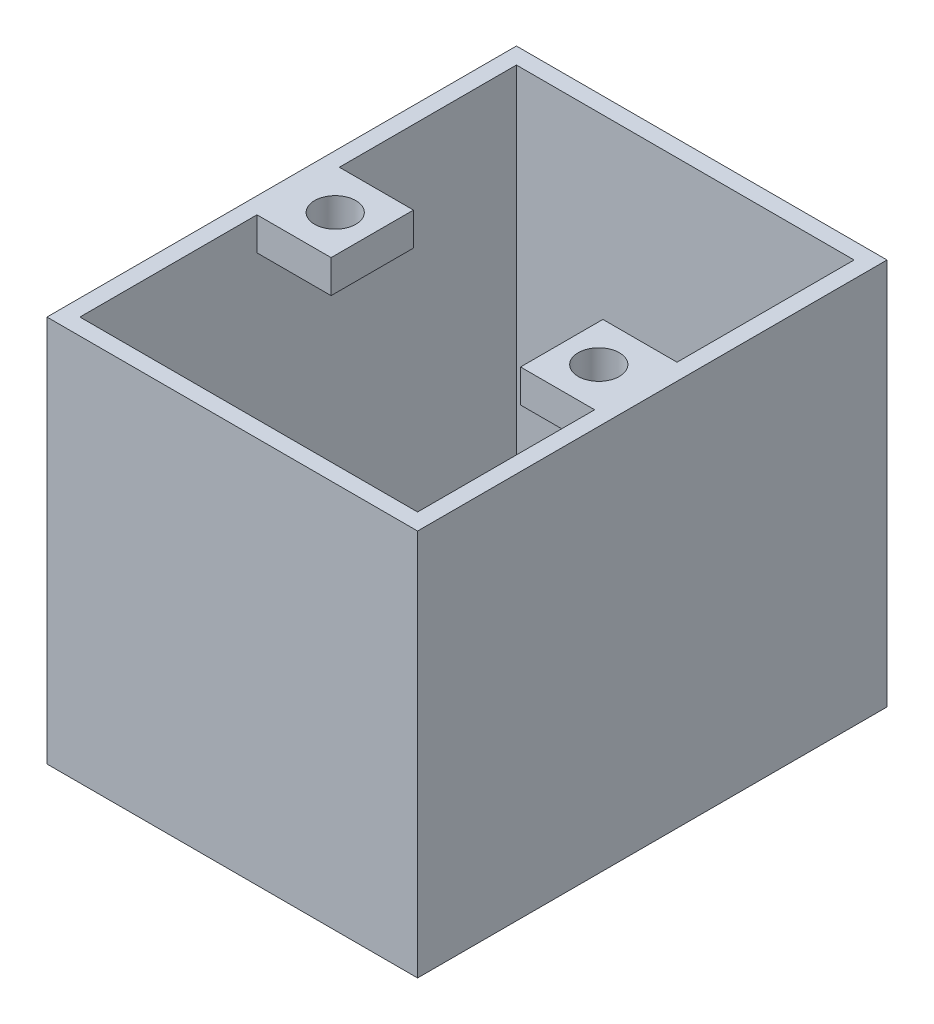
ISO-10303-21;
HEADER;
FILE_DESCRIPTION(('STEP AP214'),'2;1');
FILE_NAME('part.step','',(''),(''),'','','');
FILE_SCHEMA(('AUTOMOTIVE_DESIGN { 1 0 10303 214 1 1 1 1 }'));
ENDSEC;
DATA;
#1=APPLICATION_CONTEXT('core data for automotive mechanical design processes');
#2=APPLICATION_PROTOCOL_DEFINITION('international standard','automotive_design',2000,#1);
#3=PRODUCT_CONTEXT('',#1,'mechanical');
#4=PRODUCT('Part','Part','',(#3));
#5=PRODUCT_RELATED_PRODUCT_CATEGORY('part','',(#4));
#6=PRODUCT_DEFINITION_FORMATION('','',#4);
#7=PRODUCT_DEFINITION_CONTEXT('part definition',#1,'design');
#8=PRODUCT_DEFINITION('design','',#6,#7);
#9=PRODUCT_DEFINITION_SHAPE('','',#8);
#10=(LENGTH_UNIT() NAMED_UNIT(*) SI_UNIT(.MILLI.,.METRE.));
#11=(NAMED_UNIT(*) PLANE_ANGLE_UNIT() SI_UNIT($,.RADIAN.));
#12=(NAMED_UNIT(*) SI_UNIT($,.STERADIAN.) SOLID_ANGLE_UNIT());
#13=UNCERTAINTY_MEASURE_WITH_UNIT(LENGTH_MEASURE(1.E-05),#10,'distance_accuracy_value','');
#14=(GEOMETRIC_REPRESENTATION_CONTEXT(3) GLOBAL_UNCERTAINTY_ASSIGNED_CONTEXT((#13)) GLOBAL_UNIT_ASSIGNED_CONTEXT((#10,
#11,#12)) REPRESENTATION_CONTEXT('',''));
#15=CARTESIAN_POINT('',(0.,0.,0.));
#16=DIRECTION('',(0.,0.,1.));
#17=DIRECTION('',(1.,0.,0.));
#18=AXIS2_PLACEMENT_3D('',#15,#16,#17);
#19=CARTESIAN_POINT('',(0.,2.,0.));
#20=DIRECTION('',(0.,1.,0.));
#21=DIRECTION('',(0.,0.,1.));
#22=AXIS2_PLACEMENT_3D('',#19,#20,#21);
#23=PLANE('',#22);
#24=DIRECTION('',(0.,0.,1.));
#25=VECTOR('',#24,1.);
#26=CARTESIAN_POINT('',(-9.,2.,-48.));
#27=LINE('',#26,#25);
#28=CARTESIAN_POINT('',(-9.,2.,-48.));
#29=VERTEX_POINT('',#28);
#30=CARTESIAN_POINT('',(-9.,2.,5.));
#31=VERTEX_POINT('',#30);
#32=EDGE_CURVE('E236',#29,#31,#27,.T.);
#33=ORIENTED_EDGE('',*,*,#32,.T.);
#34=DIRECTION('',(1.,0.,0.));
#35=VECTOR('',#34,1.);
#36=CARTESIAN_POINT('',(-9.,2.,5.));
#37=LINE('',#36,#35);
#38=CARTESIAN_POINT('',(32.,2.,5.));
#39=VERTEX_POINT('',#38);
#40=EDGE_CURVE('E255',#31,#39,#37,.T.);
#41=ORIENTED_EDGE('',*,*,#40,.T.);
#42=DIRECTION('',(0.,0.,-1.));
#43=VECTOR('',#42,1.);
#44=CARTESIAN_POINT('',(32.,2.,-48.));
#45=LINE('',#44,#43);
#46=CARTESIAN_POINT('',(32.,2.,-48.));
#47=VERTEX_POINT('',#46);
#48=EDGE_CURVE('E257',#39,#47,#45,.T.);
#49=ORIENTED_EDGE('',*,*,#48,.T.);
#50=DIRECTION('',(-1.,0.,0.));
#51=VECTOR('',#50,1.);
#52=CARTESIAN_POINT('',(-9.,2.,-48.));
#53=LINE('',#52,#51);
#54=EDGE_CURVE('E259',#47,#29,#53,.T.);
#55=ORIENTED_EDGE('',*,*,#54,.T.);
#56=EDGE_LOOP('',(#33,#41,#49,#55));
#57=FACE_BOUND('',#56,.T.);
#58=DIRECTION('',(1.,0.,0.));
#59=VECTOR('',#58,1.);
#60=CARTESIAN_POINT('',(0.,2.,0.));
#61=LINE('',#60,#59);
#62=CARTESIAN_POINT('',(0.,2.,0.));
#63=VERTEX_POINT('',#62);
#64=CARTESIAN_POINT('',(23.,2.,0.));
#65=VERTEX_POINT('',#64);
#66=EDGE_CURVE('E287',#63,#65,#61,.T.);
#67=ORIENTED_EDGE('',*,*,#66,.F.);
#68=DIRECTION('',(0.,0.,1.));
#69=VECTOR('',#68,1.);
#70=CARTESIAN_POINT('',(0.,2.,0.));
#71=LINE('',#70,#69);
#72=CARTESIAN_POINT('',(0.,2.,-43.));
#73=VERTEX_POINT('',#72);
#74=EDGE_CURVE('E285',#73,#63,#71,.T.);
#75=ORIENTED_EDGE('',*,*,#74,.F.);
#76=DIRECTION('',(-1.,0.,0.));
#77=VECTOR('',#76,1.);
#78=CARTESIAN_POINT('',(0.,2.,-43.));
#79=LINE('',#78,#77);
#80=CARTESIAN_POINT('',(23.,2.,-43.));
#81=VERTEX_POINT('',#80);
#82=EDGE_CURVE('E293',#81,#73,#79,.T.);
#83=ORIENTED_EDGE('',*,*,#82,.F.);
#84=DIRECTION('',(0.,0.,-1.));
#85=VECTOR('',#84,1.);
#86=CARTESIAN_POINT('',(23.,2.,0.));
#87=LINE('',#86,#85);
#88=EDGE_CURVE('E290',#65,#81,#87,.T.);
#89=ORIENTED_EDGE('',*,*,#88,.F.);
#90=EDGE_LOOP('',(#67,#75,#83,#89));
#91=FACE_BOUND('',#90,.T.);
#92=ADVANCED_FACE('F33',(#57,#91),#23,.T.);
#93=CARTESIAN_POINT('',(0.,0.,0.));
#94=DIRECTION('',(0.,1.,0.));
#95=DIRECTION('',(0.,0.,1.));
#96=AXIS2_PLACEMENT_3D('',#93,#94,#95);
#97=PLANE('',#96);
#98=DIRECTION('',(0.,0.,1.));
#99=VECTOR('',#98,1.);
#100=CARTESIAN_POINT('',(-11.,0.,-50.));
#101=LINE('',#100,#99);
#102=CARTESIAN_POINT('',(-11.,0.,-50.));
#103=VERTEX_POINT('',#102);
#104=CARTESIAN_POINT('',(-11.,0.,7.));
#105=VERTEX_POINT('',#104);
#106=EDGE_CURVE('E315',#103,#105,#101,.T.);
#107=ORIENTED_EDGE('',*,*,#106,.F.);
#108=DIRECTION('',(-1.,0.,0.));
#109=VECTOR('',#108,1.);
#110=CARTESIAN_POINT('',(-11.,0.,-50.));
#111=LINE('',#110,#109);
#112=CARTESIAN_POINT('',(34.,0.,-50.));
#113=VERTEX_POINT('',#112);
#114=EDGE_CURVE('E322',#113,#103,#111,.T.);
#115=ORIENTED_EDGE('',*,*,#114,.F.);
#116=DIRECTION('',(0.,0.,-1.));
#117=VECTOR('',#116,1.);
#118=CARTESIAN_POINT('',(34.,0.,-50.));
#119=LINE('',#118,#117);
#120=CARTESIAN_POINT('',(34.,0.,7.));
#121=VERTEX_POINT('',#120);
#122=EDGE_CURVE('E320',#121,#113,#119,.T.);
#123=ORIENTED_EDGE('',*,*,#122,.F.);
#124=DIRECTION('',(1.,0.,0.));
#125=VECTOR('',#124,1.);
#126=CARTESIAN_POINT('',(-11.,0.,7.));
#127=LINE('',#126,#125);
#128=EDGE_CURVE('E318',#105,#121,#127,.T.);
#129=ORIENTED_EDGE('',*,*,#128,.F.);
#130=EDGE_LOOP('',(#107,#115,#123,#129));
#131=FACE_BOUND('',#130,.T.);
#132=DIRECTION('',(0.,0.,1.));
#133=VECTOR('',#132,1.);
#134=CARTESIAN_POINT('',(0.,0.,0.));
#135=LINE('',#134,#133);
#136=CARTESIAN_POINT('',(0.,0.,-43.));
#137=VERTEX_POINT('',#136);
#138=CARTESIAN_POINT('',(0.,0.,0.));
#139=VERTEX_POINT('',#138);
#140=EDGE_CURVE('E284',#137,#139,#135,.T.);
#141=ORIENTED_EDGE('',*,*,#140,.T.);
#142=DIRECTION('',(1.,0.,0.));
#143=VECTOR('',#142,1.);
#144=CARTESIAN_POINT('',(0.,0.,0.));
#145=LINE('',#144,#143);
#146=CARTESIAN_POINT('',(23.,0.,0.));
#147=VERTEX_POINT('',#146);
#148=EDGE_CURVE('E298',#139,#147,#145,.T.);
#149=ORIENTED_EDGE('',*,*,#148,.T.);
#150=DIRECTION('',(0.,0.,-1.));
#151=VECTOR('',#150,1.);
#152=CARTESIAN_POINT('',(23.,0.,0.));
#153=LINE('',#152,#151);
#154=CARTESIAN_POINT('',(23.,0.,-43.));
#155=VERTEX_POINT('',#154);
#156=EDGE_CURVE('E301',#147,#155,#153,.T.);
#157=ORIENTED_EDGE('',*,*,#156,.T.);
#158=DIRECTION('',(-1.,0.,0.));
#159=VECTOR('',#158,1.);
#160=CARTESIAN_POINT('',(0.,0.,-43.));
#161=LINE('',#160,#159);
#162=EDGE_CURVE('E288',#155,#137,#161,.T.);
#163=ORIENTED_EDGE('',*,*,#162,.T.);
#164=EDGE_LOOP('',(#141,#149,#157,#163));
#165=FACE_BOUND('',#164,.T.);
#166=ADVANCED_FACE('F339',(#131,#165),#97,.F.);
#167=CARTESIAN_POINT('',(-11.,2.,-50.));
#168=DIRECTION('',(1.,0.,0.));
#169=DIRECTION('',(0.,0.,-1.));
#170=AXIS2_PLACEMENT_3D('',#167,#168,#169);
#171=PLANE('',#170);
#172=ORIENTED_EDGE('',*,*,#106,.T.);
#173=DIRECTION('',(0.,-1.,0.));
#174=VECTOR('',#173,1.);
#175=CARTESIAN_POINT('',(-11.,2.,7.));
#176=LINE('',#175,#174);
#177=CARTESIAN_POINT('',(-11.,47.,7.));
#178=VERTEX_POINT('',#177);
#179=EDGE_CURVE('E11',#178,#105,#176,.T.);
#180=ORIENTED_EDGE('',*,*,#179,.F.);
#181=DIRECTION('',(0.,0.,1.));
#182=VECTOR('',#181,1.);
#183=CARTESIAN_POINT('',(-11.,47.,-50.));
#184=LINE('',#183,#182);
#185=CARTESIAN_POINT('',(-11.,47.,-50.));
#186=VERTEX_POINT('',#185);
#187=EDGE_CURVE('E272',#186,#178,#184,.T.);
#188=ORIENTED_EDGE('',*,*,#187,.F.);
#189=DIRECTION('',(0.,-1.,0.));
#190=VECTOR('',#189,1.);
#191=CARTESIAN_POINT('',(-11.,2.,-50.));
#192=LINE('',#191,#190);
#193=EDGE_CURVE('E324',#186,#103,#192,.T.);
#194=ORIENTED_EDGE('',*,*,#193,.T.);
#195=EDGE_LOOP('',(#172,#180,#188,#194));
#196=FACE_BOUND('',#195,.T.);
#197=ADVANCED_FACE('F35',(#196),#171,.F.);
#198=CARTESIAN_POINT('',(-11.,2.,7.));
#199=DIRECTION('',(0.,0.,-1.));
#200=DIRECTION('',(-1.,0.,0.));
#201=AXIS2_PLACEMENT_3D('',#198,#199,#200);
#202=PLANE('',#201);
#203=ORIENTED_EDGE('',*,*,#128,.T.);
#204=DIRECTION('',(0.,-1.,0.));
#205=VECTOR('',#204,1.);
#206=CARTESIAN_POINT('',(34.,2.,7.));
#207=LINE('',#206,#205);
#208=CARTESIAN_POINT('',(34.,47.,7.));
#209=VERTEX_POINT('',#208);
#210=EDGE_CURVE('E41',#209,#121,#207,.T.);
#211=ORIENTED_EDGE('',*,*,#210,.F.);
#212=DIRECTION('',(1.,0.,0.));
#213=VECTOR('',#212,1.);
#214=CARTESIAN_POINT('',(-11.,47.,7.));
#215=LINE('',#214,#213);
#216=EDGE_CURVE('E275',#178,#209,#215,.T.);
#217=ORIENTED_EDGE('',*,*,#216,.F.);
#218=ORIENTED_EDGE('',*,*,#179,.T.);
#219=EDGE_LOOP('',(#203,#211,#217,#218));
#220=FACE_BOUND('',#219,.T.);
#221=ADVANCED_FACE('F349',(#220),#202,.F.);
#222=CARTESIAN_POINT('',(34.,2.,-50.));
#223=DIRECTION('',(-1.,0.,0.));
#224=DIRECTION('',(0.,0.,1.));
#225=AXIS2_PLACEMENT_3D('',#222,#223,#224);
#226=PLANE('',#225);
#227=ORIENTED_EDGE('',*,*,#122,.T.);
#228=DIRECTION('',(0.,-1.,0.));
#229=VECTOR('',#228,1.);
#230=CARTESIAN_POINT('',(34.,2.,-50.));
#231=LINE('',#230,#229);
#232=CARTESIAN_POINT('',(34.,47.,-50.));
#233=VERTEX_POINT('',#232);
#234=EDGE_CURVE('E327',#233,#113,#231,.T.);
#235=ORIENTED_EDGE('',*,*,#234,.F.);
#236=DIRECTION('',(0.,0.,-1.));
#237=VECTOR('',#236,1.);
#238=CARTESIAN_POINT('',(34.,47.,-50.));
#239=LINE('',#238,#237);
#240=EDGE_CURVE('E278',#209,#233,#239,.T.);
#241=ORIENTED_EDGE('',*,*,#240,.F.);
#242=ORIENTED_EDGE('',*,*,#210,.T.);
#243=EDGE_LOOP('',(#227,#235,#241,#242));
#244=FACE_BOUND('',#243,.T.);
#245=ADVANCED_FACE('F333',(#244),#226,.F.);
#246=CARTESIAN_POINT('',(-11.,2.,-50.));
#247=DIRECTION('',(0.,0.,1.));
#248=DIRECTION('',(1.,0.,0.));
#249=AXIS2_PLACEMENT_3D('',#246,#247,#248);
#250=PLANE('',#249);
#251=ORIENTED_EDGE('',*,*,#114,.T.);
#252=ORIENTED_EDGE('',*,*,#193,.F.);
#253=DIRECTION('',(-1.,0.,0.));
#254=VECTOR('',#253,1.);
#255=CARTESIAN_POINT('',(-11.,47.,-50.));
#256=LINE('',#255,#254);
#257=EDGE_CURVE('E281',#233,#186,#256,.T.);
#258=ORIENTED_EDGE('',*,*,#257,.F.);
#259=ORIENTED_EDGE('',*,*,#234,.T.);
#260=EDGE_LOOP('',(#251,#252,#258,#259));
#261=FACE_BOUND('',#260,.T.);
#262=ADVANCED_FACE('F342',(#261),#250,.F.);
#263=CARTESIAN_POINT('',(0.,2.,0.));
#264=DIRECTION('',(1.,0.,0.));
#265=DIRECTION('',(0.,0.,-1.));
#266=AXIS2_PLACEMENT_3D('',#263,#264,#265);
#267=PLANE('',#266);
#268=ORIENTED_EDGE('',*,*,#140,.F.);
#269=DIRECTION('',(0.,-1.,0.));
#270=VECTOR('',#269,1.);
#271=CARTESIAN_POINT('',(0.,2.,-43.));
#272=LINE('',#271,#270);
#273=EDGE_CURVE('E295',#73,#137,#272,.T.);
#274=ORIENTED_EDGE('',*,*,#273,.F.);
#275=ORIENTED_EDGE('',*,*,#74,.T.);
#276=DIRECTION('',(0.,-1.,0.));
#277=VECTOR('',#276,1.);
#278=CARTESIAN_POINT('',(0.,2.,0.));
#279=LINE('',#278,#277);
#280=EDGE_CURVE('E312',#63,#139,#279,.T.);
#281=ORIENTED_EDGE('',*,*,#280,.T.);
#282=EDGE_LOOP('',(#268,#274,#275,#281));
#283=FACE_BOUND('',#282,.T.);
#284=ADVANCED_FACE('F365',(#283),#267,.T.);
#285=CARTESIAN_POINT('',(0.,2.,0.));
#286=DIRECTION('',(0.,0.,-1.));
#287=DIRECTION('',(-1.,0.,0.));
#288=AXIS2_PLACEMENT_3D('',#285,#286,#287);
#289=PLANE('',#288);
#290=ORIENTED_EDGE('',*,*,#148,.F.);
#291=ORIENTED_EDGE('',*,*,#280,.F.);
#292=ORIENTED_EDGE('',*,*,#66,.T.);
#293=DIRECTION('',(0.,-1.,0.));
#294=VECTOR('',#293,1.);
#295=CARTESIAN_POINT('',(23.,2.,0.));
#296=LINE('',#295,#294);
#297=EDGE_CURVE('E310',#65,#147,#296,.T.);
#298=ORIENTED_EDGE('',*,*,#297,.T.);
#299=EDGE_LOOP('',(#290,#291,#292,#298));
#300=FACE_BOUND('',#299,.T.);
#301=ADVANCED_FACE('F372',(#300),#289,.T.);
#302=CARTESIAN_POINT('',(23.,2.,0.));
#303=DIRECTION('',(-1.,0.,0.));
#304=DIRECTION('',(0.,0.,1.));
#305=AXIS2_PLACEMENT_3D('',#302,#303,#304);
#306=PLANE('',#305);
#307=ORIENTED_EDGE('',*,*,#156,.F.);
#308=ORIENTED_EDGE('',*,*,#297,.F.);
#309=ORIENTED_EDGE('',*,*,#88,.T.);
#310=DIRECTION('',(0.,-1.,0.));
#311=VECTOR('',#310,1.);
#312=CARTESIAN_POINT('',(23.,2.,-43.));
#313=LINE('',#312,#311);
#314=EDGE_CURVE('E308',#81,#155,#313,.T.);
#315=ORIENTED_EDGE('',*,*,#314,.T.);
#316=EDGE_LOOP('',(#307,#308,#309,#315));
#317=FACE_BOUND('',#316,.T.);
#318=ADVANCED_FACE('F377',(#317),#306,.T.);
#319=CARTESIAN_POINT('',(0.,2.,-43.));
#320=DIRECTION('',(0.,0.,1.));
#321=DIRECTION('',(1.,0.,0.));
#322=AXIS2_PLACEMENT_3D('',#319,#320,#321);
#323=PLANE('',#322);
#324=ORIENTED_EDGE('',*,*,#162,.F.);
#325=ORIENTED_EDGE('',*,*,#314,.F.);
#326=ORIENTED_EDGE('',*,*,#82,.T.);
#327=ORIENTED_EDGE('',*,*,#273,.T.);
#328=EDGE_LOOP('',(#324,#325,#326,#327));
#329=FACE_BOUND('',#328,.T.);
#330=ADVANCED_FACE('F384',(#329),#323,.T.);
#331=CARTESIAN_POINT('',(0.,47.,0.));
#332=DIRECTION('',(0.,1.,0.));
#333=DIRECTION('',(0.,0.,1.));
#334=AXIS2_PLACEMENT_3D('',#331,#332,#333);
#335=PLANE('',#334);
#336=ORIENTED_EDGE('',*,*,#187,.T.);
#337=ORIENTED_EDGE('',*,*,#216,.T.);
#338=ORIENTED_EDGE('',*,*,#240,.T.);
#339=ORIENTED_EDGE('',*,*,#257,.T.);
#340=EDGE_LOOP('',(#336,#337,#338,#339));
#341=FACE_BOUND('',#340,.T.);
#342=DIRECTION('',(1.,0.,0.));
#343=VECTOR('',#342,1.);
#344=CARTESIAN_POINT('',(-9.,47.,5.));
#345=LINE('',#344,#343);
#346=CARTESIAN_POINT('',(-9.,47.,5.));
#347=VERTEX_POINT('',#346);
#348=CARTESIAN_POINT('',(32.,47.,5.));
#349=VERTEX_POINT('',#348);
#350=EDGE_CURVE('E245',#347,#349,#345,.T.);
#351=ORIENTED_EDGE('',*,*,#350,.F.);
#352=DIRECTION('',(0.,0.,1.));
#353=VECTOR('',#352,1.);
#354=CARTESIAN_POINT('',(-9.,47.,-48.));
#355=LINE('',#354,#353);
#356=CARTESIAN_POINT('',(-9.,47.,-16.5));
#357=VERTEX_POINT('',#356);
#358=EDGE_CURVE('E246',#357,#347,#355,.T.);
#359=ORIENTED_EDGE('',*,*,#358,.F.);
#360=DIRECTION('',(1.,0.,0.));
#361=VECTOR('',#360,1.);
#362=CARTESIAN_POINT('',(-9.,47.,-16.5));
#363=LINE('',#362,#361);
#364=CARTESIAN_POINT('',(0.,47.,-16.5));
#365=VERTEX_POINT('',#364);
#366=EDGE_CURVE('E210',#357,#365,#363,.T.);
#367=ORIENTED_EDGE('',*,*,#366,.T.);
#368=DIRECTION('',(0.,0.,-1.));
#369=VECTOR('',#368,1.);
#370=CARTESIAN_POINT('',(0.,47.,-26.5));
#371=LINE('',#370,#369);
#372=CARTESIAN_POINT('',(0.,47.,-26.5));
#373=VERTEX_POINT('',#372);
#374=EDGE_CURVE('E228',#365,#373,#371,.T.);
#375=ORIENTED_EDGE('',*,*,#374,.T.);
#376=DIRECTION('',(-1.,0.,0.));
#377=VECTOR('',#376,1.);
#378=CARTESIAN_POINT('',(-9.,47.,-26.5));
#379=LINE('',#378,#377);
#380=CARTESIAN_POINT('',(-9.,47.,-26.5));
#381=VERTEX_POINT('',#380);
#382=EDGE_CURVE('E216',#373,#381,#379,.T.);
#383=ORIENTED_EDGE('',*,*,#382,.T.);
#384=CARTESIAN_POINT('',(-9.,47.,-48.));
#385=VERTEX_POINT('',#384);
#386=EDGE_CURVE('E243',#385,#381,#355,.T.);
#387=ORIENTED_EDGE('',*,*,#386,.F.);
#388=DIRECTION('',(-1.,0.,0.));
#389=VECTOR('',#388,1.);
#390=CARTESIAN_POINT('',(-9.,47.,-48.));
#391=LINE('',#390,#389);
#392=CARTESIAN_POINT('',(32.,47.,-48.));
#393=VERTEX_POINT('',#392);
#394=EDGE_CURVE('E251',#393,#385,#391,.T.);
#395=ORIENTED_EDGE('',*,*,#394,.F.);
#396=DIRECTION('',(0.,0.,-1.));
#397=VECTOR('',#396,1.);
#398=CARTESIAN_POINT('',(32.,47.,-48.));
#399=LINE('',#398,#397);
#400=CARTESIAN_POINT('',(32.,47.,-26.5));
#401=VERTEX_POINT('',#400);
#402=EDGE_CURVE('E248',#401,#393,#399,.T.);
#403=ORIENTED_EDGE('',*,*,#402,.F.);
#404=DIRECTION('',(-1.,0.,0.));
#405=VECTOR('',#404,1.);
#406=CARTESIAN_POINT('',(23.,47.,-26.5));
#407=LINE('',#406,#405);
#408=CARTESIAN_POINT('',(23.,47.,-26.5));
#409=VERTEX_POINT('',#408);
#410=EDGE_CURVE('E197',#401,#409,#407,.T.);
#411=ORIENTED_EDGE('',*,*,#410,.T.);
#412=DIRECTION('',(0.,0.,1.));
#413=VECTOR('',#412,1.);
#414=CARTESIAN_POINT('',(23.,47.,-26.5));
#415=LINE('',#414,#413);
#416=CARTESIAN_POINT('',(23.,47.,-16.5));
#417=VERTEX_POINT('',#416);
#418=EDGE_CURVE('E175',#409,#417,#415,.T.);
#419=ORIENTED_EDGE('',*,*,#418,.T.);
#420=DIRECTION('',(1.,0.,0.));
#421=VECTOR('',#420,1.);
#422=CARTESIAN_POINT('',(23.,47.,-16.5));
#423=LINE('',#422,#421);
#424=CARTESIAN_POINT('',(32.,47.,-16.5));
#425=VERTEX_POINT('',#424);
#426=EDGE_CURVE('E192',#417,#425,#423,.T.);
#427=ORIENTED_EDGE('',*,*,#426,.T.);
#428=EDGE_CURVE('E249',#349,#425,#399,.T.);
#429=ORIENTED_EDGE('',*,*,#428,.F.);
#430=EDGE_LOOP('',(#351,#359,#367,#375,#383,#387,#395,#403,#411,#419,#427,#429));
#431=FACE_BOUND('',#430,.T.);
#432=CARTESIAN_POINT('',(-4.5,47.,-21.5));
#433=DIRECTION('',(0.,1.,0.));
#434=DIRECTION('',(0.,0.,1.));
#435=AXIS2_PLACEMENT_3D('',#432,#433,#434);
#436=CIRCLE('',#435,2.5);
#437=CARTESIAN_POINT('',(-4.5,47.,-19.));
#438=VERTEX_POINT('',#437);
#439=EDGE_CURVE('E204',#438,#438,#436,.T.);
#440=ORIENTED_EDGE('',*,*,#439,.F.);
#441=EDGE_LOOP('',(#440));
#442=FACE_BOUND('',#441,.T.);
#443=CARTESIAN_POINT('',(27.5,47.,-21.5));
#444=DIRECTION('',(0.,1.,0.));
#445=DIRECTION('',(0.,0.,1.));
#446=AXIS2_PLACEMENT_3D('',#443,#444,#445);
#447=CIRCLE('',#446,2.5);
#448=CARTESIAN_POINT('',(27.5,47.,-19.));
#449=VERTEX_POINT('',#448);
#450=EDGE_CURVE('E456',#449,#449,#447,.T.);
#451=ORIENTED_EDGE('',*,*,#450,.F.);
#452=EDGE_LOOP('',(#451));
#453=FACE_BOUND('',#452,.T.);
#454=ADVANCED_FACE('F347',(#341,#431,#442,#453),#335,.T.);
#455=CARTESIAN_POINT('',(-9.,47.,-48.));
#456=DIRECTION('',(1.,0.,0.));
#457=DIRECTION('',(0.,0.,-1.));
#458=AXIS2_PLACEMENT_3D('',#455,#456,#457);
#459=PLANE('',#458);
#460=DIRECTION('',(0.,1.,0.));
#461=VECTOR('',#460,1.);
#462=CARTESIAN_POINT('',(-9.,43.,-26.5));
#463=LINE('',#462,#461);
#464=CARTESIAN_POINT('',(-9.,43.,-26.5));
#465=VERTEX_POINT('',#464);
#466=EDGE_CURVE('E233',#465,#381,#463,.T.);
#467=ORIENTED_EDGE('',*,*,#466,.F.);
#468=DIRECTION('',(0.,0.,1.));
#469=VECTOR('',#468,1.);
#470=CARTESIAN_POINT('',(-9.,43.,-26.5));
#471=LINE('',#470,#469);
#472=CARTESIAN_POINT('',(-9.,43.,-16.5));
#473=VERTEX_POINT('',#472);
#474=EDGE_CURVE('E213',#465,#473,#471,.T.);
#475=ORIENTED_EDGE('',*,*,#474,.T.);
#476=DIRECTION('',(0.,1.,0.));
#477=VECTOR('',#476,1.);
#478=CARTESIAN_POINT('',(-9.,43.,-16.5));
#479=LINE('',#478,#477);
#480=EDGE_CURVE('E225',#473,#357,#479,.T.);
#481=ORIENTED_EDGE('',*,*,#480,.T.);
#482=ORIENTED_EDGE('',*,*,#358,.T.);
#483=DIRECTION('',(0.,-1.,0.));
#484=VECTOR('',#483,1.);
#485=CARTESIAN_POINT('',(-9.,47.,5.));
#486=LINE('',#485,#484);
#487=EDGE_CURVE('E269',#347,#31,#486,.T.);
#488=ORIENTED_EDGE('',*,*,#487,.T.);
#489=ORIENTED_EDGE('',*,*,#32,.F.);
#490=DIRECTION('',(0.,-1.,0.));
#491=VECTOR('',#490,1.);
#492=CARTESIAN_POINT('',(-9.,47.,-48.));
#493=LINE('',#492,#491);
#494=EDGE_CURVE('E253',#385,#29,#493,.T.);
#495=ORIENTED_EDGE('',*,*,#494,.F.);
#496=ORIENTED_EDGE('',*,*,#386,.T.);
#497=EDGE_LOOP('',(#467,#475,#481,#482,#488,#489,#495,#496));
#498=FACE_BOUND('',#497,.T.);
#499=ADVANCED_FACE('F400',(#498),#459,.T.);
#500=CARTESIAN_POINT('',(-9.,47.,5.));
#501=DIRECTION('',(0.,0.,-1.));
#502=DIRECTION('',(-1.,0.,0.));
#503=AXIS2_PLACEMENT_3D('',#500,#501,#502);
#504=PLANE('',#503);
#505=ORIENTED_EDGE('',*,*,#40,.F.);
#506=ORIENTED_EDGE('',*,*,#487,.F.);
#507=ORIENTED_EDGE('',*,*,#350,.T.);
#508=DIRECTION('',(0.,-1.,0.));
#509=VECTOR('',#508,1.);
#510=CARTESIAN_POINT('',(32.,47.,5.));
#511=LINE('',#510,#509);
#512=EDGE_CURVE('E266',#349,#39,#511,.T.);
#513=ORIENTED_EDGE('',*,*,#512,.T.);
#514=EDGE_LOOP('',(#505,#506,#507,#513));
#515=FACE_BOUND('',#514,.T.);
#516=ADVANCED_FACE('F403',(#515),#504,.T.);
#517=CARTESIAN_POINT('',(32.,47.,-48.));
#518=DIRECTION('',(-1.,0.,0.));
#519=DIRECTION('',(0.,0.,1.));
#520=AXIS2_PLACEMENT_3D('',#517,#518,#519);
#521=PLANE('',#520);
#522=DIRECTION('',(0.,1.,0.));
#523=VECTOR('',#522,1.);
#524=CARTESIAN_POINT('',(32.,43.,-16.5));
#525=LINE('',#524,#523);
#526=CARTESIAN_POINT('',(32.,43.,-16.5));
#527=VERTEX_POINT('',#526);
#528=EDGE_CURVE('E53',#527,#425,#525,.T.);
#529=ORIENTED_EDGE('',*,*,#528,.F.);
#530=DIRECTION('',(0.,0.,-1.));
#531=VECTOR('',#530,1.);
#532=CARTESIAN_POINT('',(32.,43.,-26.5));
#533=LINE('',#532,#531);
#534=CARTESIAN_POINT('',(32.,43.,-26.5));
#535=VERTEX_POINT('',#534);
#536=EDGE_CURVE('E48',#527,#535,#533,.T.);
#537=ORIENTED_EDGE('',*,*,#536,.T.);
#538=DIRECTION('',(0.,1.,0.));
#539=VECTOR('',#538,1.);
#540=CARTESIAN_POINT('',(32.,43.,-26.5));
#541=LINE('',#540,#539);
#542=EDGE_CURVE('E181',#535,#401,#541,.T.);
#543=ORIENTED_EDGE('',*,*,#542,.T.);
#544=ORIENTED_EDGE('',*,*,#402,.T.);
#545=DIRECTION('',(0.,-1.,0.));
#546=VECTOR('',#545,1.);
#547=CARTESIAN_POINT('',(32.,47.,-48.));
#548=LINE('',#547,#546);
#549=EDGE_CURVE('E263',#393,#47,#548,.T.);
#550=ORIENTED_EDGE('',*,*,#549,.T.);
#551=ORIENTED_EDGE('',*,*,#48,.F.);
#552=ORIENTED_EDGE('',*,*,#512,.F.);
#553=ORIENTED_EDGE('',*,*,#428,.T.);
#554=EDGE_LOOP('',(#529,#537,#543,#544,#550,#551,#552,#553));
#555=FACE_BOUND('',#554,.T.);
#556=ADVANCED_FACE('F407',(#555),#521,.T.);
#557=CARTESIAN_POINT('',(-9.,47.,-48.));
#558=DIRECTION('',(0.,0.,1.));
#559=DIRECTION('',(1.,0.,0.));
#560=AXIS2_PLACEMENT_3D('',#557,#558,#559);
#561=PLANE('',#560);
#562=ORIENTED_EDGE('',*,*,#54,.F.);
#563=ORIENTED_EDGE('',*,*,#549,.F.);
#564=ORIENTED_EDGE('',*,*,#394,.T.);
#565=ORIENTED_EDGE('',*,*,#494,.T.);
#566=EDGE_LOOP('',(#562,#563,#564,#565));
#567=FACE_BOUND('',#566,.T.);
#568=ADVANCED_FACE('F411',(#567),#561,.T.);
#569=CARTESIAN_POINT('',(-9.,43.,-26.5));
#570=DIRECTION('',(0.,0.,-1.));
#571=DIRECTION('',(-1.,0.,0.));
#572=AXIS2_PLACEMENT_3D('',#569,#570,#571);
#573=PLANE('',#572);
#574=ORIENTED_EDGE('',*,*,#382,.F.);
#575=DIRECTION('',(0.,1.,0.));
#576=VECTOR('',#575,1.);
#577=CARTESIAN_POINT('',(0.,43.,-26.5));
#578=LINE('',#577,#576);
#579=CARTESIAN_POINT('',(0.,43.,-26.5));
#580=VERTEX_POINT('',#579);
#581=EDGE_CURVE('E237',#580,#373,#578,.T.);
#582=ORIENTED_EDGE('',*,*,#581,.F.);
#583=DIRECTION('',(-1.,0.,0.));
#584=VECTOR('',#583,1.);
#585=CARTESIAN_POINT('',(-9.,43.,-26.5));
#586=LINE('',#585,#584);
#587=EDGE_CURVE('E222',#580,#465,#586,.T.);
#588=ORIENTED_EDGE('',*,*,#587,.T.);
#589=ORIENTED_EDGE('',*,*,#466,.T.);
#590=EDGE_LOOP('',(#574,#582,#588,#589));
#591=FACE_BOUND('',#590,.T.);
#592=ADVANCED_FACE('F414',(#591),#573,.T.);
#593=CARTESIAN_POINT('',(0.,43.,-26.5));
#594=DIRECTION('',(1.,0.,0.));
#595=DIRECTION('',(0.,0.,-1.));
#596=AXIS2_PLACEMENT_3D('',#593,#594,#595);
#597=PLANE('',#596);
#598=ORIENTED_EDGE('',*,*,#374,.F.);
#599=DIRECTION('',(0.,1.,0.));
#600=VECTOR('',#599,1.);
#601=CARTESIAN_POINT('',(0.,43.,-16.5));
#602=LINE('',#601,#600);
#603=CARTESIAN_POINT('',(0.,43.,-16.5));
#604=VERTEX_POINT('',#603);
#605=EDGE_CURVE('E239',#604,#365,#602,.T.);
#606=ORIENTED_EDGE('',*,*,#605,.F.);
#607=DIRECTION('',(0.,0.,-1.));
#608=VECTOR('',#607,1.);
#609=CARTESIAN_POINT('',(0.,43.,-26.5));
#610=LINE('',#609,#608);
#611=EDGE_CURVE('E219',#604,#580,#610,.T.);
#612=ORIENTED_EDGE('',*,*,#611,.T.);
#613=ORIENTED_EDGE('',*,*,#581,.T.);
#614=EDGE_LOOP('',(#598,#606,#612,#613));
#615=FACE_BOUND('',#614,.T.);
#616=ADVANCED_FACE('F420',(#615),#597,.T.);
#617=CARTESIAN_POINT('',(-9.,43.,-16.5));
#618=DIRECTION('',(0.,0.,1.));
#619=DIRECTION('',(1.,0.,0.));
#620=AXIS2_PLACEMENT_3D('',#617,#618,#619);
#621=PLANE('',#620);
#622=ORIENTED_EDGE('',*,*,#366,.F.);
#623=ORIENTED_EDGE('',*,*,#480,.F.);
#624=DIRECTION('',(1.,0.,0.));
#625=VECTOR('',#624,1.);
#626=CARTESIAN_POINT('',(-9.,43.,-16.5));
#627=LINE('',#626,#625);
#628=EDGE_CURVE('E215',#473,#604,#627,.T.);
#629=ORIENTED_EDGE('',*,*,#628,.T.);
#630=ORIENTED_EDGE('',*,*,#605,.T.);
#631=EDGE_LOOP('',(#622,#623,#629,#630));
#632=FACE_BOUND('',#631,.T.);
#633=ADVANCED_FACE('F416',(#632),#621,.T.);
#634=CARTESIAN_POINT('',(0.,43.,0.));
#635=DIRECTION('',(0.,1.,0.));
#636=DIRECTION('',(0.,0.,1.));
#637=AXIS2_PLACEMENT_3D('',#634,#635,#636);
#638=PLANE('',#637);
#639=CARTESIAN_POINT('',(-4.5,43.,-21.5));
#640=DIRECTION('',(0.,1.,0.));
#641=DIRECTION('',(0.,0.,1.));
#642=AXIS2_PLACEMENT_3D('',#639,#640,#641);
#643=CIRCLE('',#642,2.5);
#644=CARTESIAN_POINT('',(-4.5,43.,-19.));
#645=VERTEX_POINT('',#644);
#646=EDGE_CURVE('E207',#645,#645,#643,.T.);
#647=ORIENTED_EDGE('',*,*,#646,.T.);
#648=EDGE_LOOP('',(#647));
#649=FACE_BOUND('',#648,.T.);
#650=ORIENTED_EDGE('',*,*,#474,.F.);
#651=ORIENTED_EDGE('',*,*,#587,.F.);
#652=ORIENTED_EDGE('',*,*,#611,.F.);
#653=ORIENTED_EDGE('',*,*,#628,.F.);
#654=EDGE_LOOP('',(#650,#651,#652,#653));
#655=FACE_BOUND('',#654,.T.);
#656=ADVANCED_FACE('F419',(#649,#655),#638,.F.);
#657=CARTESIAN_POINT('',(-4.5,43.,-21.5));
#658=DIRECTION('',(0.,1.,0.));
#659=DIRECTION('',(0.,0.,1.));
#660=AXIS2_PLACEMENT_3D('',#657,#658,#659);
#661=CYLINDRICAL_SURFACE('',#660,2.5);
#662=ORIENTED_EDGE('',*,*,#646,.F.);
#663=EDGE_LOOP('',(#662));
#664=FACE_BOUND('',#663,.T.);
#665=ORIENTED_EDGE('',*,*,#439,.T.);
#666=EDGE_LOOP('',(#665));
#667=FACE_BOUND('',#666,.T.);
#668=ADVANCED_FACE('F430',(#664,#667),#661,.F.);
#669=CARTESIAN_POINT('',(23.,43.,-16.5));
#670=DIRECTION('',(0.,0.,1.));
#671=DIRECTION('',(1.,0.,0.));
#672=AXIS2_PLACEMENT_3D('',#669,#670,#671);
#673=PLANE('',#672);
#674=ORIENTED_EDGE('',*,*,#426,.F.);
#675=DIRECTION('',(0.,1.,0.));
#676=VECTOR('',#675,1.);
#677=CARTESIAN_POINT('',(23.,43.,-16.5));
#678=LINE('',#677,#676);
#679=CARTESIAN_POINT('',(23.,43.,-16.5));
#680=VERTEX_POINT('',#679);
#681=EDGE_CURVE('E180',#680,#417,#678,.T.);
#682=ORIENTED_EDGE('',*,*,#681,.F.);
#683=DIRECTION('',(1.,0.,0.));
#684=VECTOR('',#683,1.);
#685=CARTESIAN_POINT('',(23.,43.,-16.5));
#686=LINE('',#685,#684);
#687=EDGE_CURVE('E188',#680,#527,#686,.T.);
#688=ORIENTED_EDGE('',*,*,#687,.T.);
#689=ORIENTED_EDGE('',*,*,#528,.T.);
#690=EDGE_LOOP('',(#674,#682,#688,#689));
#691=FACE_BOUND('',#690,.T.);
#692=ADVANCED_FACE('F434',(#691),#673,.T.);
#693=CARTESIAN_POINT('',(23.,43.,-26.5));
#694=DIRECTION('',(-1.,0.,0.));
#695=DIRECTION('',(0.,0.,1.));
#696=AXIS2_PLACEMENT_3D('',#693,#694,#695);
#697=PLANE('',#696);
#698=ORIENTED_EDGE('',*,*,#418,.F.);
#699=DIRECTION('',(0.,1.,0.));
#700=VECTOR('',#699,1.);
#701=CARTESIAN_POINT('',(23.,43.,-26.5));
#702=LINE('',#701,#700);
#703=CARTESIAN_POINT('',(23.,43.,-26.5));
#704=VERTEX_POINT('',#703);
#705=EDGE_CURVE('E169',#704,#409,#702,.T.);
#706=ORIENTED_EDGE('',*,*,#705,.F.);
#707=DIRECTION('',(0.,0.,1.));
#708=VECTOR('',#707,1.);
#709=CARTESIAN_POINT('',(23.,43.,-26.5));
#710=LINE('',#709,#708);
#711=EDGE_CURVE('E172',#704,#680,#710,.T.);
#712=ORIENTED_EDGE('',*,*,#711,.T.);
#713=ORIENTED_EDGE('',*,*,#681,.T.);
#714=EDGE_LOOP('',(#698,#706,#712,#713));
#715=FACE_BOUND('',#714,.T.);
#716=ADVANCED_FACE('F171',(#715),#697,.T.);
#717=CARTESIAN_POINT('',(23.,43.,-26.5));
#718=DIRECTION('',(0.,0.,-1.));
#719=DIRECTION('',(-1.,0.,0.));
#720=AXIS2_PLACEMENT_3D('',#717,#718,#719);
#721=PLANE('',#720);
#722=ORIENTED_EDGE('',*,*,#410,.F.);
#723=ORIENTED_EDGE('',*,*,#542,.F.);
#724=DIRECTION('',(-1.,0.,0.));
#725=VECTOR('',#724,1.);
#726=CARTESIAN_POINT('',(23.,43.,-26.5));
#727=LINE('',#726,#725);
#728=EDGE_CURVE('E186',#535,#704,#727,.T.);
#729=ORIENTED_EDGE('',*,*,#728,.T.);
#730=ORIENTED_EDGE('',*,*,#705,.T.);
#731=EDGE_LOOP('',(#722,#723,#729,#730));
#732=FACE_BOUND('',#731,.T.);
#733=ADVANCED_FACE('F190',(#732),#721,.T.);
#734=CARTESIAN_POINT('',(0.,43.,0.));
#735=DIRECTION('',(0.,1.,0.));
#736=DIRECTION('',(0.,0.,1.));
#737=AXIS2_PLACEMENT_3D('',#734,#735,#736);
#738=PLANE('',#737);
#739=CARTESIAN_POINT('',(27.5,43.,-21.5));
#740=DIRECTION('',(0.,1.,0.));
#741=DIRECTION('',(0.,0.,1.));
#742=AXIS2_PLACEMENT_3D('',#739,#740,#741);
#743=CIRCLE('',#742,2.5);
#744=CARTESIAN_POINT('',(27.5,43.,-19.));
#745=VERTEX_POINT('',#744);
#746=EDGE_CURVE('E199',#745,#745,#743,.T.);
#747=ORIENTED_EDGE('',*,*,#746,.T.);
#748=EDGE_LOOP('',(#747));
#749=FACE_BOUND('',#748,.T.);
#750=ORIENTED_EDGE('',*,*,#536,.F.);
#751=ORIENTED_EDGE('',*,*,#687,.F.);
#752=ORIENTED_EDGE('',*,*,#711,.F.);
#753=ORIENTED_EDGE('',*,*,#728,.F.);
#754=EDGE_LOOP('',(#750,#751,#752,#753));
#755=FACE_BOUND('',#754,.T.);
#756=ADVANCED_FACE('F185',(#749,#755),#738,.F.);
#757=CARTESIAN_POINT('',(27.5,43.,-21.5));
#758=DIRECTION('',(0.,1.,0.));
#759=DIRECTION('',(0.,0.,1.));
#760=AXIS2_PLACEMENT_3D('',#757,#758,#759);
#761=CYLINDRICAL_SURFACE('',#760,2.5);
#762=ORIENTED_EDGE('',*,*,#746,.F.);
#763=EDGE_LOOP('',(#762));
#764=FACE_BOUND('',#763,.T.);
#765=ORIENTED_EDGE('',*,*,#450,.T.);
#766=EDGE_LOOP('',(#765));
#767=FACE_BOUND('',#766,.T.);
#768=ADVANCED_FACE('F445',(#764,#767),#761,.F.);
#769=CLOSED_SHELL('',(#92,#166,#197,#221,#245,#262,#284,#301,#318,#330,#454,#499,#516,#556,#568,
#592,#616,#633,#656,#668,#692,#716,#733,#756,#768));
#770=MANIFOLD_SOLID_BREP('B2',#769);
#771=ADVANCED_BREP_SHAPE_REPRESENTATION('',(#18,#770),#14);
#772=SHAPE_DEFINITION_REPRESENTATION(#9,#771);
ENDSEC;
END-ISO-10303-21;
